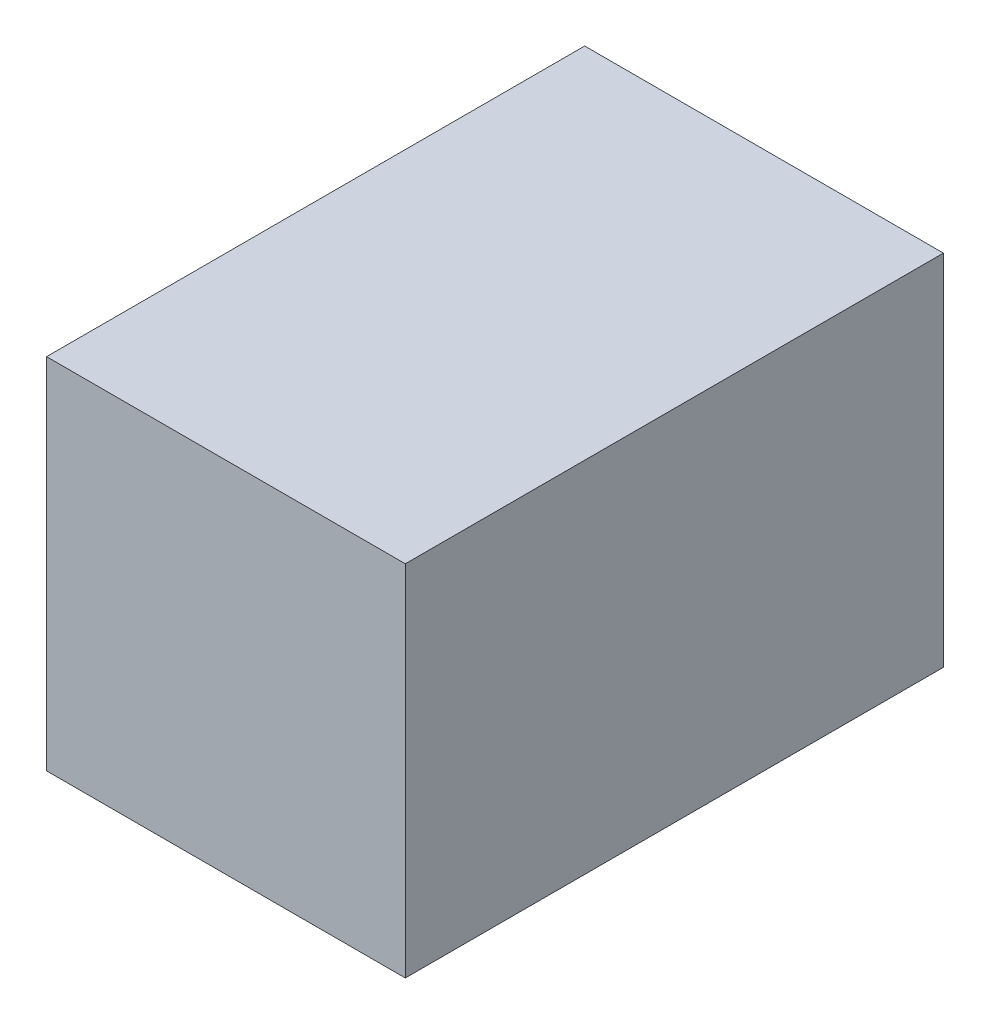
ISO-10303-21;
HEADER;
FILE_DESCRIPTION(('STEP AP214'),'2;1');
FILE_NAME('part.step','',(''),(''),'','','');
FILE_SCHEMA(('AUTOMOTIVE_DESIGN { 1 0 10303 214 1 1 1 1 }'));
ENDSEC;
DATA;
#1=APPLICATION_CONTEXT('core data for automotive mechanical design processes');
#2=APPLICATION_PROTOCOL_DEFINITION('international standard','automotive_design',2000,#1);
#3=PRODUCT_CONTEXT('',#1,'mechanical');
#4=PRODUCT('Part','Part','',(#3));
#5=PRODUCT_RELATED_PRODUCT_CATEGORY('part','',(#4));
#6=PRODUCT_DEFINITION_FORMATION('','',#4);
#7=PRODUCT_DEFINITION_CONTEXT('part definition',#1,'design');
#8=PRODUCT_DEFINITION('design','',#6,#7);
#9=PRODUCT_DEFINITION_SHAPE('','',#8);
#10=(LENGTH_UNIT() NAMED_UNIT(*) SI_UNIT(.MILLI.,.METRE.));
#11=(NAMED_UNIT(*) PLANE_ANGLE_UNIT() SI_UNIT($,.RADIAN.));
#12=(NAMED_UNIT(*) SI_UNIT($,.STERADIAN.) SOLID_ANGLE_UNIT());
#13=UNCERTAINTY_MEASURE_WITH_UNIT(LENGTH_MEASURE(1.E-05),#10,'distance_accuracy_value','');
#14=(GEOMETRIC_REPRESENTATION_CONTEXT(3) GLOBAL_UNCERTAINTY_ASSIGNED_CONTEXT((#13)) GLOBAL_UNIT_ASSIGNED_CONTEXT((#10,
#11,#12)) REPRESENTATION_CONTEXT('',''));
#15=CARTESIAN_POINT('',(0.,0.,0.));
#16=DIRECTION('',(0.,0.,1.));
#17=DIRECTION('',(1.,0.,0.));
#18=AXIS2_PLACEMENT_3D('',#15,#16,#17);
#19=CARTESIAN_POINT('',(25.,-25.,37.5));
#20=DIRECTION('',(-1.,0.,0.));
#21=DIRECTION('',(0.,0.,1.));
#22=AXIS2_PLACEMENT_3D('',#19,#20,#21);
#23=PLANE('',#22);
#24=DIRECTION('',(0.,1.,0.));
#25=VECTOR('',#24,1.);
#26=CARTESIAN_POINT('',(25.,-25.,-37.5));
#27=LINE('',#26,#25);
#28=CARTESIAN_POINT('',(25.,-25.,-37.5));
#29=VERTEX_POINT('',#28);
#30=CARTESIAN_POINT('',(25.,25.,-37.5));
#31=VERTEX_POINT('',#30);
#32=EDGE_CURVE('E100',#29,#31,#27,.T.);
#33=ORIENTED_EDGE('',*,*,#32,.T.);
#34=DIRECTION('',(0.,0.,-1.));
#35=VECTOR('',#34,1.);
#36=CARTESIAN_POINT('',(25.,25.,37.5));
#37=LINE('',#36,#35);
#38=CARTESIAN_POINT('',(25.,25.,37.5));
#39=VERTEX_POINT('',#38);
#40=EDGE_CURVE('E11',#39,#31,#37,.T.);
#41=ORIENTED_EDGE('',*,*,#40,.F.);
#42=DIRECTION('',(0.,1.,0.));
#43=VECTOR('',#42,1.);
#44=CARTESIAN_POINT('',(25.,-25.,37.5));
#45=LINE('',#44,#43);
#46=CARTESIAN_POINT('',(25.,-25.,37.5));
#47=VERTEX_POINT('',#46);
#48=EDGE_CURVE('E88',#47,#39,#45,.T.);
#49=ORIENTED_EDGE('',*,*,#48,.F.);
#50=DIRECTION('',(0.,0.,-1.));
#51=VECTOR('',#50,1.);
#52=CARTESIAN_POINT('',(25.,-25.,37.5));
#53=LINE('',#52,#51);
#54=EDGE_CURVE('E96',#47,#29,#53,.T.);
#55=ORIENTED_EDGE('',*,*,#54,.T.);
#56=EDGE_LOOP('',(#33,#41,#49,#55));
#57=FACE_BOUND('',#56,.T.);
#58=ADVANCED_FACE('F37',(#57),#23,.F.);
#59=CARTESIAN_POINT('',(-25.,25.,37.5));
#60=DIRECTION('',(0.,-1.,0.));
#61=DIRECTION('',(0.,0.,-1.));
#62=AXIS2_PLACEMENT_3D('',#59,#60,#61);
#63=PLANE('',#62);
#64=DIRECTION('',(-1.,0.,0.));
#65=VECTOR('',#64,1.);
#66=CARTESIAN_POINT('',(-25.,25.,-37.5));
#67=LINE('',#66,#65);
#68=CARTESIAN_POINT('',(-25.,25.,-37.5));
#69=VERTEX_POINT('',#68);
#70=EDGE_CURVE('E92',#31,#69,#67,.T.);
#71=ORIENTED_EDGE('',*,*,#70,.T.);
#72=DIRECTION('',(0.,0.,-1.));
#73=VECTOR('',#72,1.);
#74=CARTESIAN_POINT('',(-25.,25.,37.5));
#75=LINE('',#74,#73);
#76=CARTESIAN_POINT('',(-25.,25.,37.5));
#77=VERTEX_POINT('',#76);
#78=EDGE_CURVE('E45',#77,#69,#75,.T.);
#79=ORIENTED_EDGE('',*,*,#78,.F.);
#80=DIRECTION('',(-1.,0.,0.));
#81=VECTOR('',#80,1.);
#82=CARTESIAN_POINT('',(-25.,25.,37.5));
#83=LINE('',#82,#81);
#84=EDGE_CURVE('E83',#39,#77,#83,.T.);
#85=ORIENTED_EDGE('',*,*,#84,.F.);
#86=ORIENTED_EDGE('',*,*,#40,.T.);
#87=EDGE_LOOP('',(#71,#79,#85,#86));
#88=FACE_BOUND('',#87,.T.);
#89=ADVANCED_FACE('F91',(#88),#63,.F.);
#90=CARTESIAN_POINT('',(-25.,-25.,37.5));
#91=DIRECTION('',(1.,0.,0.));
#92=DIRECTION('',(0.,0.,-1.));
#93=AXIS2_PLACEMENT_3D('',#90,#91,#92);
#94=PLANE('',#93);
#95=DIRECTION('',(0.,-1.,0.));
#96=VECTOR('',#95,1.);
#97=CARTESIAN_POINT('',(-25.,-25.,-37.5));
#98=LINE('',#97,#96);
#99=CARTESIAN_POINT('',(-25.,-25.,-37.5));
#100=VERTEX_POINT('',#99);
#101=EDGE_CURVE('E70',#69,#100,#98,.T.);
#102=ORIENTED_EDGE('',*,*,#101,.T.);
#103=DIRECTION('',(0.,0.,-1.));
#104=VECTOR('',#103,1.);
#105=CARTESIAN_POINT('',(-25.,-25.,37.5));
#106=LINE('',#105,#104);
#107=CARTESIAN_POINT('',(-25.,-25.,37.5));
#108=VERTEX_POINT('',#107);
#109=EDGE_CURVE('E93',#108,#100,#106,.T.);
#110=ORIENTED_EDGE('',*,*,#109,.F.);
#111=DIRECTION('',(0.,-1.,0.));
#112=VECTOR('',#111,1.);
#113=CARTESIAN_POINT('',(-25.,-25.,37.5));
#114=LINE('',#113,#112);
#115=EDGE_CURVE('E86',#77,#108,#114,.T.);
#116=ORIENTED_EDGE('',*,*,#115,.F.);
#117=ORIENTED_EDGE('',*,*,#78,.T.);
#118=EDGE_LOOP('',(#102,#110,#116,#117));
#119=FACE_BOUND('',#118,.T.);
#120=ADVANCED_FACE('F94',(#119),#94,.F.);
#121=CARTESIAN_POINT('',(-25.,-25.,37.5));
#122=DIRECTION('',(0.,1.,0.));
#123=DIRECTION('',(0.,0.,1.));
#124=AXIS2_PLACEMENT_3D('',#121,#122,#123);
#125=PLANE('',#124);
#126=DIRECTION('',(1.,0.,0.));
#127=VECTOR('',#126,1.);
#128=CARTESIAN_POINT('',(-25.,-25.,-37.5));
#129=LINE('',#128,#127);
#130=EDGE_CURVE('E76',#100,#29,#129,.T.);
#131=ORIENTED_EDGE('',*,*,#130,.T.);
#132=ORIENTED_EDGE('',*,*,#54,.F.);
#133=DIRECTION('',(1.,0.,0.));
#134=VECTOR('',#133,1.);
#135=CARTESIAN_POINT('',(-25.,-25.,37.5));
#136=LINE('',#135,#134);
#137=EDGE_CURVE('E53',#108,#47,#136,.T.);
#138=ORIENTED_EDGE('',*,*,#137,.F.);
#139=ORIENTED_EDGE('',*,*,#109,.T.);
#140=EDGE_LOOP('',(#131,#132,#138,#139));
#141=FACE_BOUND('',#140,.T.);
#142=ADVANCED_FACE('F107',(#141),#125,.F.);
#143=CARTESIAN_POINT('',(0.,0.,37.5));
#144=DIRECTION('',(0.,0.,-1.));
#145=DIRECTION('',(-1.,0.,0.));
#146=AXIS2_PLACEMENT_3D('',#143,#144,#145);
#147=PLANE('',#146);
#148=ORIENTED_EDGE('',*,*,#48,.T.);
#149=ORIENTED_EDGE('',*,*,#84,.T.);
#150=ORIENTED_EDGE('',*,*,#115,.T.);
#151=ORIENTED_EDGE('',*,*,#137,.T.);
#152=EDGE_LOOP('',(#148,#149,#150,#151));
#153=FACE_BOUND('',#152,.T.);
#154=ADVANCED_FACE('F84',(#153),#147,.F.);
#155=CARTESIAN_POINT('',(0.,0.,-37.5));
#156=DIRECTION('',(0.,0.,-1.));
#157=DIRECTION('',(-1.,0.,0.));
#158=AXIS2_PLACEMENT_3D('',#155,#156,#157);
#159=PLANE('',#158);
#160=ORIENTED_EDGE('',*,*,#32,.F.);
#161=ORIENTED_EDGE('',*,*,#130,.F.);
#162=ORIENTED_EDGE('',*,*,#101,.F.);
#163=ORIENTED_EDGE('',*,*,#70,.F.);
#164=EDGE_LOOP('',(#160,#161,#162,#163));
#165=FACE_BOUND('',#164,.T.);
#166=ADVANCED_FACE('F110',(#165),#159,.T.);
#167=CLOSED_SHELL('',(#58,#89,#120,#142,#154,#166));
#168=MANIFOLD_SOLID_BREP('B2',#167);
#169=ADVANCED_BREP_SHAPE_REPRESENTATION('',(#18,#168),#14);
#170=SHAPE_DEFINITION_REPRESENTATION(#9,#169);
ENDSEC;
END-ISO-10303-21;
